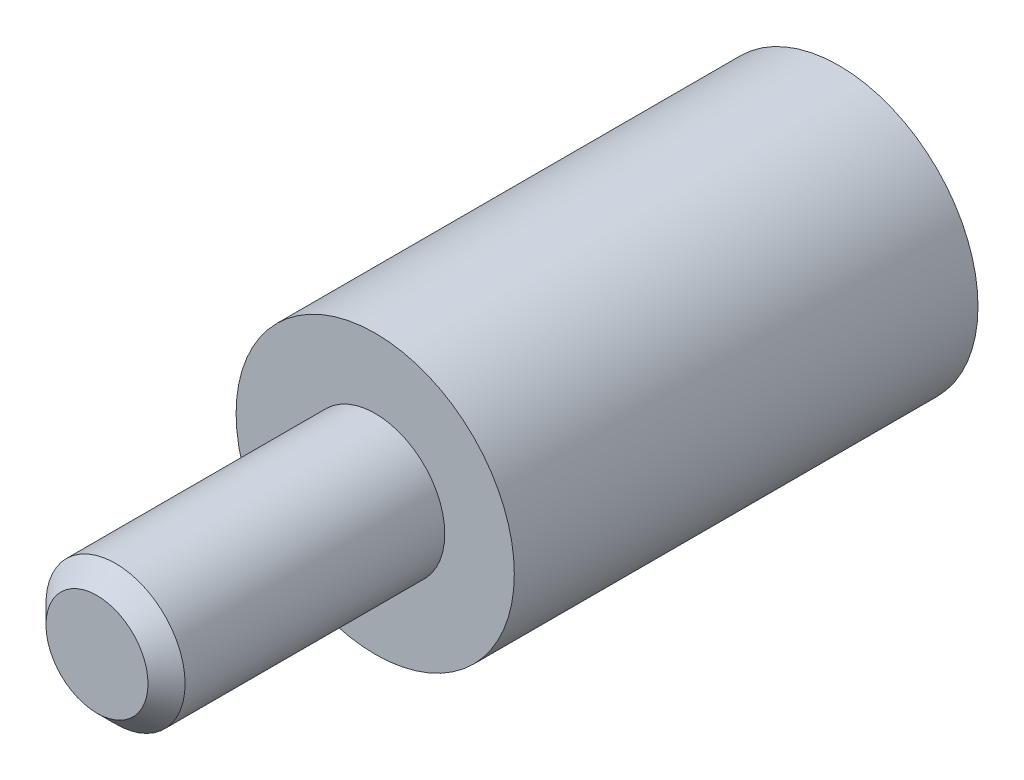
ISO-10303-21;
HEADER;
FILE_DESCRIPTION(('STEP AP214'),'2;1');
FILE_NAME('part.step','',(''),(''),'','','');
FILE_SCHEMA(('AUTOMOTIVE_DESIGN { 1 0 10303 214 1 1 1 1 }'));
ENDSEC;
DATA;
#1=APPLICATION_CONTEXT('core data for automotive mechanical design processes');
#2=APPLICATION_PROTOCOL_DEFINITION('international standard','automotive_design',2000,#1);
#3=PRODUCT_CONTEXT('',#1,'mechanical');
#4=PRODUCT('Part','Part','',(#3));
#5=PRODUCT_RELATED_PRODUCT_CATEGORY('part','',(#4));
#6=PRODUCT_DEFINITION_FORMATION('','',#4);
#7=PRODUCT_DEFINITION_CONTEXT('part definition',#1,'design');
#8=PRODUCT_DEFINITION('design','',#6,#7);
#9=PRODUCT_DEFINITION_SHAPE('','',#8);
#10=(LENGTH_UNIT() NAMED_UNIT(*) SI_UNIT(.MILLI.,.METRE.));
#11=(NAMED_UNIT(*) PLANE_ANGLE_UNIT() SI_UNIT($,.RADIAN.));
#12=(NAMED_UNIT(*) SI_UNIT($,.STERADIAN.) SOLID_ANGLE_UNIT());
#13=UNCERTAINTY_MEASURE_WITH_UNIT(LENGTH_MEASURE(1.E-05),#10,'distance_accuracy_value','');
#14=(GEOMETRIC_REPRESENTATION_CONTEXT(3) GLOBAL_UNCERTAINTY_ASSIGNED_CONTEXT((#13)) GLOBAL_UNIT_ASSIGNED_CONTEXT((#10,
#11,#12)) REPRESENTATION_CONTEXT('',''));
#15=CARTESIAN_POINT('',(0.,0.,0.));
#16=DIRECTION('',(0.,0.,1.));
#17=DIRECTION('',(1.,0.,0.));
#18=AXIS2_PLACEMENT_3D('',#15,#16,#17);
#19=CARTESIAN_POINT('',(0.,0.,10.));
#20=DIRECTION('',(0.,0.,-1.));
#21=DIRECTION('',(-1.,0.,0.));
#22=AXIS2_PLACEMENT_3D('',#19,#20,#21);
#23=CYLINDRICAL_SURFACE('',#22,3.);
#24=CARTESIAN_POINT('',(0.,0.,10.));
#25=DIRECTION('',(0.,0.,1.));
#26=DIRECTION('',(1.,0.,0.));
#27=AXIS2_PLACEMENT_3D('',#24,#25,#26);
#28=CIRCLE('',#27,3.);
#29=CARTESIAN_POINT('',(3.,0.,10.));
#30=VERTEX_POINT('',#29);
#31=EDGE_CURVE('E75',#30,#30,#28,.T.);
#32=ORIENTED_EDGE('',*,*,#31,.F.);
#33=EDGE_LOOP('',(#32));
#34=FACE_BOUND('',#33,.T.);
#35=CARTESIAN_POINT('',(0.,0.,0.));
#36=DIRECTION('',(0.,0.,1.));
#37=DIRECTION('',(1.,0.,0.));
#38=AXIS2_PLACEMENT_3D('',#35,#36,#37);
#39=CIRCLE('',#38,3.);
#40=CARTESIAN_POINT('',(3.,0.,0.));
#41=VERTEX_POINT('',#40);
#42=EDGE_CURVE('E72',#41,#41,#39,.T.);
#43=ORIENTED_EDGE('',*,*,#42,.T.);
#44=EDGE_LOOP('',(#43));
#45=FACE_BOUND('',#44,.T.);
#46=ADVANCED_FACE('F51',(#34,#45),#23,.T.);
#47=CARTESIAN_POINT('',(0.,0.,10.));
#48=DIRECTION('',(0.,0.,1.));
#49=DIRECTION('',(1.,0.,0.));
#50=AXIS2_PLACEMENT_3D('',#47,#48,#49);
#51=PLANE('',#50);
#52=CARTESIAN_POINT('',(0.,0.,10.));
#53=DIRECTION('',(0.,0.,1.));
#54=DIRECTION('',(1.,0.,0.));
#55=AXIS2_PLACEMENT_3D('',#52,#53,#54);
#56=CIRCLE('',#55,1.5);
#57=CARTESIAN_POINT('',(1.5,0.,10.));
#58=VERTEX_POINT('',#57);
#59=EDGE_CURVE('E78',#58,#58,#56,.T.);
#60=ORIENTED_EDGE('',*,*,#59,.F.);
#61=EDGE_LOOP('',(#60));
#62=FACE_BOUND('',#61,.T.);
#63=ORIENTED_EDGE('',*,*,#31,.T.);
#64=EDGE_LOOP('',(#63));
#65=FACE_BOUND('',#64,.T.);
#66=ADVANCED_FACE('F102',(#62,#65),#51,.T.);
#67=CARTESIAN_POINT('',(0.,0.,0.));
#68=DIRECTION('',(0.,0.,1.));
#69=DIRECTION('',(1.,0.,0.));
#70=AXIS2_PLACEMENT_3D('',#67,#68,#69);
#71=PLANE('',#70);
#72=CARTESIAN_POINT('',(0.,0.,0.));
#73=DIRECTION('',(0.,0.,1.));
#74=DIRECTION('',(1.,0.,0.));
#75=AXIS2_PLACEMENT_3D('',#72,#73,#74);
#76=CIRCLE('',#75,1.64999999999999);
#77=CARTESIAN_POINT('',(1.64999999999999,0.,0.));
#78=VERTEX_POINT('',#77);
#79=EDGE_CURVE('E86',#78,#78,#76,.T.);
#80=ORIENTED_EDGE('',*,*,#79,.T.);
#81=EDGE_LOOP('',(#80));
#82=FACE_BOUND('',#81,.T.);
#83=ORIENTED_EDGE('',*,*,#42,.F.);
#84=EDGE_LOOP('',(#83));
#85=FACE_BOUND('',#84,.T.);
#86=ADVANCED_FACE('F110',(#82,#85),#71,.F.);
#87=CARTESIAN_POINT('',(0.,0.,16.));
#88=DIRECTION('',(0.,0.,-1.));
#89=DIRECTION('',(-1.,0.,0.));
#90=AXIS2_PLACEMENT_3D('',#87,#88,#89);
#91=CYLINDRICAL_SURFACE('',#90,1.5);
#92=CARTESIAN_POINT('',(0.,0.,15.6));
#93=DIRECTION('',(0.,0.,1.));
#94=DIRECTION('',(1.,0.,0.));
#95=AXIS2_PLACEMENT_3D('',#92,#93,#94);
#96=CIRCLE('',#95,1.5);
#97=CARTESIAN_POINT('',(1.5,0.,15.6));
#98=VERTEX_POINT('',#97);
#99=EDGE_CURVE('E11',#98,#98,#96,.F.);
#100=ORIENTED_EDGE('',*,*,#99,.T.);
#101=EDGE_LOOP('',(#100));
#102=FACE_BOUND('',#101,.T.);
#103=ORIENTED_EDGE('',*,*,#59,.T.);
#104=EDGE_LOOP('',(#103));
#105=FACE_BOUND('',#104,.T.);
#106=ADVANCED_FACE('F122',(#102,#105),#91,.T.);
#107=CARTESIAN_POINT('',(0.,0.,16.));
#108=DIRECTION('',(0.,0.,1.));
#109=DIRECTION('',(1.,0.,0.));
#110=AXIS2_PLACEMENT_3D('',#107,#108,#109);
#111=PLANE('',#110);
#112=CARTESIAN_POINT('',(0.,0.,16.));
#113=DIRECTION('',(0.,0.,1.));
#114=DIRECTION('',(1.,0.,0.));
#115=AXIS2_PLACEMENT_3D('',#112,#113,#114);
#116=CIRCLE('',#115,1.1);
#117=CARTESIAN_POINT('',(1.1,0.,16.));
#118=VERTEX_POINT('',#117);
#119=EDGE_CURVE('E59',#118,#118,#116,.T.);
#120=ORIENTED_EDGE('',*,*,#119,.T.);
#121=EDGE_LOOP('',(#120));
#122=FACE_BOUND('',#121,.T.);
#123=ADVANCED_FACE('F66',(#122),#111,.T.);
#124=CARTESIAN_POINT('',(0.,0.,8.5));
#125=DIRECTION('',(0.,0.,-1.));
#126=DIRECTION('',(-1.,0.,0.));
#127=AXIS2_PLACEMENT_3D('',#124,#125,#126);
#128=CONICAL_SURFACE('',#127,1.25,1.02974425867665);
#129=CARTESIAN_POINT('',(0.,0.,9.25107577378445));
#130=VERTEX_POINT('',#129);
#131=VERTEX_LOOP('',#130);
#132=FACE_BOUND('',#131,.T.);
#133=CARTESIAN_POINT('',(0.,0.,8.5));
#134=DIRECTION('',(0.,0.,-1.));
#135=DIRECTION('',(-1.,0.,0.));
#136=AXIS2_PLACEMENT_3D('',#133,#134,#135);
#137=CIRCLE('',#136,1.25);
#138=CARTESIAN_POINT('',(-1.25,0.,8.5));
#139=VERTEX_POINT('',#138);
#140=EDGE_CURVE('E70',#139,#139,#137,.T.);
#141=ORIENTED_EDGE('',*,*,#140,.T.);
#142=EDGE_LOOP('',(#141));
#143=FACE_BOUND('',#142,.T.);
#144=ADVANCED_FACE('F62',(#132,#143),#128,.F.);
#145=CARTESIAN_POINT('',(0.,0.,0.));
#146=DIRECTION('',(0.,0.,-1.));
#147=DIRECTION('',(-1.,0.,0.));
#148=AXIS2_PLACEMENT_3D('',#145,#146,#147);
#149=CYLINDRICAL_SURFACE('',#148,1.24999999999999);
#150=CARTESIAN_POINT('',(0.,0.,0.399999999999994));
#151=DIRECTION('',(0.,0.,1.));
#152=DIRECTION('',(1.,0.,0.));
#153=AXIS2_PLACEMENT_3D('',#150,#151,#152);
#154=CIRCLE('',#153,1.24999999999999);
#155=CARTESIAN_POINT('',(1.24999999999999,0.,0.399999999999994));
#156=VERTEX_POINT('',#155);
#157=EDGE_CURVE('E81',#156,#156,#154,.F.);
#158=ORIENTED_EDGE('',*,*,#157,.T.);
#159=EDGE_LOOP('',(#158));
#160=FACE_BOUND('',#159,.T.);
#161=ORIENTED_EDGE('',*,*,#140,.F.);
#162=EDGE_LOOP('',(#161));
#163=FACE_BOUND('',#162,.T.);
#164=ADVANCED_FACE('F65',(#160,#163),#149,.F.);
#165=CARTESIAN_POINT('',(0.,0.,0.399999999999994));
#166=DIRECTION('',(0.,0.,-1.));
#167=DIRECTION('',(-1.,0.,0.));
#168=AXIS2_PLACEMENT_3D('',#165,#166,#167);
#169=CONICAL_SURFACE('',#168,1.24999999999999,0.785398163397452);
#170=ORIENTED_EDGE('',*,*,#79,.F.);
#171=EDGE_LOOP('',(#170));
#172=FACE_BOUND('',#171,.T.);
#173=ORIENTED_EDGE('',*,*,#157,.F.);
#174=EDGE_LOOP('',(#173));
#175=FACE_BOUND('',#174,.T.);
#176=ADVANCED_FACE('F93',(#172,#175),#169,.F.);
#177=CARTESIAN_POINT('',(0.,0.,16.));
#178=DIRECTION('',(0.,0.,-1.));
#179=DIRECTION('',(-1.,0.,0.));
#180=AXIS2_PLACEMENT_3D('',#177,#178,#179);
#181=CONICAL_SURFACE('',#180,1.1,0.785398163397449);
#182=ORIENTED_EDGE('',*,*,#99,.F.);
#183=EDGE_LOOP('',(#182));
#184=FACE_BOUND('',#183,.T.);
#185=ORIENTED_EDGE('',*,*,#119,.F.);
#186=EDGE_LOOP('',(#185));
#187=FACE_BOUND('',#186,.T.);
#188=ADVANCED_FACE('F54',(#184,#187),#181,.T.);
#189=CLOSED_SHELL('',(#46,#66,#86,#106,#123,#144,#164,#176,#188));
#190=MANIFOLD_SOLID_BREP('B2',#189);
#191=ADVANCED_BREP_SHAPE_REPRESENTATION('',(#18,#190),#14);
#192=SHAPE_DEFINITION_REPRESENTATION(#9,#191);
ENDSEC;
END-ISO-10303-21;
